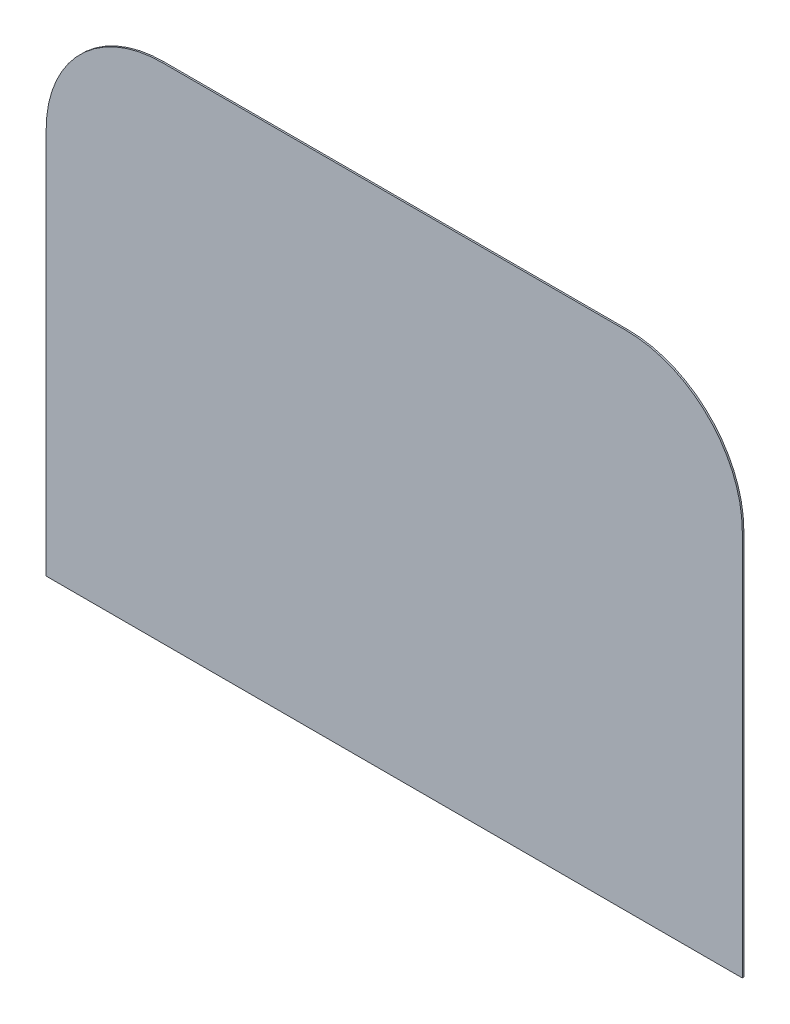
ISO-10303-21;
HEADER;
FILE_DESCRIPTION(('STEP AP214'),'2;1');
FILE_NAME('part.step','',(''),(''),'','','');
FILE_SCHEMA(('AUTOMOTIVE_DESIGN { 1 0 10303 214 1 1 1 1 }'));
ENDSEC;
DATA;
#1=APPLICATION_CONTEXT('core data for automotive mechanical design processes');
#2=APPLICATION_PROTOCOL_DEFINITION('international standard','automotive_design',2000,#1);
#3=PRODUCT_CONTEXT('',#1,'mechanical');
#4=PRODUCT('Part','Part','',(#3));
#5=PRODUCT_RELATED_PRODUCT_CATEGORY('part','',(#4));
#6=PRODUCT_DEFINITION_FORMATION('','',#4);
#7=PRODUCT_DEFINITION_CONTEXT('part definition',#1,'design');
#8=PRODUCT_DEFINITION('design','',#6,#7);
#9=PRODUCT_DEFINITION_SHAPE('','',#8);
#10=(LENGTH_UNIT() NAMED_UNIT(*) SI_UNIT(.MILLI.,.METRE.));
#11=(NAMED_UNIT(*) PLANE_ANGLE_UNIT() SI_UNIT($,.RADIAN.));
#12=(NAMED_UNIT(*) SI_UNIT($,.STERADIAN.) SOLID_ANGLE_UNIT());
#13=UNCERTAINTY_MEASURE_WITH_UNIT(LENGTH_MEASURE(1.E-05),#10,'distance_accuracy_value','');
#14=(GEOMETRIC_REPRESENTATION_CONTEXT(3) GLOBAL_UNCERTAINTY_ASSIGNED_CONTEXT((#13)) GLOBAL_UNIT_ASSIGNED_CONTEXT((#10,
#11,#12)) REPRESENTATION_CONTEXT('',''));
#15=CARTESIAN_POINT('',(0.,0.,0.));
#16=DIRECTION('',(0.,0.,1.));
#17=DIRECTION('',(1.,0.,0.));
#18=AXIS2_PLACEMENT_3D('',#15,#16,#17);
#19=CARTESIAN_POINT('',(297.350901998723,163.0081300813,1.));
#20=DIRECTION('',(-1.,0.,0.));
#21=DIRECTION('',(0.,0.,1.));
#22=AXIS2_PLACEMENT_3D('',#19,#20,#21);
#23=PLANE('',#22);
#24=DIRECTION('',(0.,1.,0.));
#25=VECTOR('',#24,1.);
#26=CARTESIAN_POINT('',(297.350901998723,163.0081300813,0.));
#27=LINE('',#26,#25);
#28=CARTESIAN_POINT('',(297.350901998723,-86.9918699186992,0.));
#29=VERTEX_POINT('',#28);
#30=CARTESIAN_POINT('',(297.350901998723,163.0081300813,0.));
#31=VERTEX_POINT('',#30);
#32=EDGE_CURVE('E121',#29,#31,#27,.T.);
#33=ORIENTED_EDGE('',*,*,#32,.T.);
#34=DIRECTION('',(0.,0.,-1.));
#35=VECTOR('',#34,1.);
#36=CARTESIAN_POINT('',(297.350901998723,163.0081300813,1.));
#37=LINE('',#36,#35);
#38=CARTESIAN_POINT('',(297.350901998723,163.0081300813,1.));
#39=VERTEX_POINT('',#38);
#40=EDGE_CURVE('E41',#39,#31,#37,.T.);
#41=ORIENTED_EDGE('',*,*,#40,.F.);
#42=DIRECTION('',(0.,1.,0.));
#43=VECTOR('',#42,1.);
#44=CARTESIAN_POINT('',(297.350901998723,163.0081300813,1.));
#45=LINE('',#44,#43);
#46=CARTESIAN_POINT('',(297.350901998723,-86.9918699186992,1.));
#47=VERTEX_POINT('',#46);
#48=EDGE_CURVE('E87',#47,#39,#45,.T.);
#49=ORIENTED_EDGE('',*,*,#48,.F.);
#50=DIRECTION('',(0.,0.,-1.));
#51=VECTOR('',#50,1.);
#52=CARTESIAN_POINT('',(297.350901998723,-86.9918699186992,1.));
#53=LINE('',#52,#51);
#54=EDGE_CURVE('E11',#47,#29,#53,.T.);
#55=ORIENTED_EDGE('',*,*,#54,.T.);
#56=EDGE_LOOP('',(#33,#41,#49,#55));
#57=FACE_BOUND('',#56,.T.);
#58=ADVANCED_FACE('F33',(#57),#23,.F.);
#59=CARTESIAN_POINT('',(222.350901998723,163.008130081301,1.));
#60=DIRECTION('',(0.,0.,-1.));
#61=DIRECTION('',(-1.,0.,0.));
#62=AXIS2_PLACEMENT_3D('',#59,#60,#61);
#63=CYLINDRICAL_SURFACE('',#62,75.);
#64=CARTESIAN_POINT('',(222.350901998723,163.008130081301,0.));
#65=DIRECTION('',(0.,0.,1.));
#66=DIRECTION('',(-1.,0.,0.));
#67=AXIS2_PLACEMENT_3D('',#64,#65,#66);
#68=CIRCLE('',#67,75.);
#69=CARTESIAN_POINT('',(222.350901998722,238.008130081301,0.));
#70=VERTEX_POINT('',#69);
#71=EDGE_CURVE('E123',#31,#70,#68,.T.);
#72=ORIENTED_EDGE('',*,*,#71,.T.);
#73=DIRECTION('',(0.,0.,-1.));
#74=VECTOR('',#73,1.);
#75=CARTESIAN_POINT('',(222.350901998722,238.008130081301,1.));
#76=LINE('',#75,#74);
#77=CARTESIAN_POINT('',(222.350901998722,238.008130081301,1.));
#78=VERTEX_POINT('',#77);
#79=EDGE_CURVE('E110',#78,#70,#76,.T.);
#80=ORIENTED_EDGE('',*,*,#79,.F.);
#81=CARTESIAN_POINT('',(222.350901998723,163.008130081301,1.));
#82=DIRECTION('',(0.,0.,1.));
#83=DIRECTION('',(-1.,0.,0.));
#84=AXIS2_PLACEMENT_3D('',#81,#82,#83);
#85=CIRCLE('',#84,75.);
#86=EDGE_CURVE('E101',#39,#78,#85,.T.);
#87=ORIENTED_EDGE('',*,*,#86,.F.);
#88=ORIENTED_EDGE('',*,*,#40,.T.);
#89=EDGE_LOOP('',(#72,#80,#87,#88));
#90=FACE_BOUND('',#89,.T.);
#91=ADVANCED_FACE('F135',(#90),#63,.T.);
#92=CARTESIAN_POINT('',(-77.6490980012769,238.008130081301,1.));
#93=DIRECTION('',(0.,-1.,0.));
#94=DIRECTION('',(0.,0.,-1.));
#95=AXIS2_PLACEMENT_3D('',#92,#93,#94);
#96=PLANE('',#95);
#97=DIRECTION('',(-1.,0.,0.));
#98=VECTOR('',#97,1.);
#99=CARTESIAN_POINT('',(-77.6490980012769,238.008130081301,0.));
#100=LINE('',#99,#98);
#101=CARTESIAN_POINT('',(-77.6490980012769,238.008130081301,0.));
#102=VERTEX_POINT('',#101);
#103=EDGE_CURVE('E109',#70,#102,#100,.T.);
#104=ORIENTED_EDGE('',*,*,#103,.T.);
#105=DIRECTION('',(0.,0.,-1.));
#106=VECTOR('',#105,1.);
#107=CARTESIAN_POINT('',(-77.6490980012769,238.008130081301,1.));
#108=LINE('',#107,#106);
#109=CARTESIAN_POINT('',(-77.6490980012769,238.008130081301,1.));
#110=VERTEX_POINT('',#109);
#111=EDGE_CURVE('E106',#110,#102,#108,.T.);
#112=ORIENTED_EDGE('',*,*,#111,.F.);
#113=DIRECTION('',(-1.,0.,0.));
#114=VECTOR('',#113,1.);
#115=CARTESIAN_POINT('',(-77.6490980012769,238.008130081301,1.));
#116=LINE('',#115,#114);
#117=EDGE_CURVE('E95',#78,#110,#116,.T.);
#118=ORIENTED_EDGE('',*,*,#117,.F.);
#119=ORIENTED_EDGE('',*,*,#79,.T.);
#120=EDGE_LOOP('',(#104,#112,#118,#119));
#121=FACE_BOUND('',#120,.T.);
#122=ADVANCED_FACE('F107',(#121),#96,.F.);
#123=CARTESIAN_POINT('',(-77.6490980012774,163.008130081301,1.));
#124=DIRECTION('',(0.,0.,-1.));
#125=DIRECTION('',(-1.,0.,0.));
#126=AXIS2_PLACEMENT_3D('',#123,#124,#125);
#127=CYLINDRICAL_SURFACE('',#126,75.);
#128=CARTESIAN_POINT('',(-77.6490980012774,163.008130081301,0.));
#129=DIRECTION('',(0.,0.,1.));
#130=DIRECTION('',(-1.,0.,0.));
#131=AXIS2_PLACEMENT_3D('',#128,#129,#130);
#132=CIRCLE('',#131,75.);
#133=CARTESIAN_POINT('',(-152.649098001277,163.0081300813,0.));
#134=VERTEX_POINT('',#133);
#135=EDGE_CURVE('E73',#102,#134,#132,.T.);
#136=ORIENTED_EDGE('',*,*,#135,.T.);
#137=DIRECTION('',(0.,0.,-1.));
#138=VECTOR('',#137,1.);
#139=CARTESIAN_POINT('',(-152.649098001277,163.0081300813,1.));
#140=LINE('',#139,#138);
#141=CARTESIAN_POINT('',(-152.649098001277,163.0081300813,1.));
#142=VERTEX_POINT('',#141);
#143=EDGE_CURVE('E111',#142,#134,#140,.T.);
#144=ORIENTED_EDGE('',*,*,#143,.F.);
#145=CARTESIAN_POINT('',(-77.6490980012774,163.008130081301,1.));
#146=DIRECTION('',(0.,0.,1.));
#147=DIRECTION('',(-1.,0.,0.));
#148=AXIS2_PLACEMENT_3D('',#145,#146,#147);
#149=CIRCLE('',#148,75.);
#150=EDGE_CURVE('E99',#110,#142,#149,.T.);
#151=ORIENTED_EDGE('',*,*,#150,.F.);
#152=ORIENTED_EDGE('',*,*,#111,.T.);
#153=EDGE_LOOP('',(#136,#144,#151,#152));
#154=FACE_BOUND('',#153,.T.);
#155=ADVANCED_FACE('F113',(#154),#127,.T.);
#156=CARTESIAN_POINT('',(-152.649098001277,-86.9918699186992,1.));
#157=DIRECTION('',(1.,0.,0.));
#158=DIRECTION('',(0.,0.,-1.));
#159=AXIS2_PLACEMENT_3D('',#156,#157,#158);
#160=PLANE('',#159);
#161=DIRECTION('',(0.,-1.,0.));
#162=VECTOR('',#161,1.);
#163=CARTESIAN_POINT('',(-152.649098001277,-86.9918699186992,0.));
#164=LINE('',#163,#162);
#165=CARTESIAN_POINT('',(-152.649098001277,-86.9918699186992,0.));
#166=VERTEX_POINT('',#165);
#167=EDGE_CURVE('E80',#134,#166,#164,.T.);
#168=ORIENTED_EDGE('',*,*,#167,.T.);
#169=DIRECTION('',(0.,0.,-1.));
#170=VECTOR('',#169,1.);
#171=CARTESIAN_POINT('',(-152.649098001277,-86.9918699186992,1.));
#172=LINE('',#171,#170);
#173=CARTESIAN_POINT('',(-152.649098001277,-86.9918699186992,1.));
#174=VERTEX_POINT('',#173);
#175=EDGE_CURVE('E117',#174,#166,#172,.T.);
#176=ORIENTED_EDGE('',*,*,#175,.F.);
#177=DIRECTION('',(0.,-1.,0.));
#178=VECTOR('',#177,1.);
#179=CARTESIAN_POINT('',(-152.649098001277,-86.9918699186992,1.));
#180=LINE('',#179,#178);
#181=EDGE_CURVE('E115',#142,#174,#180,.T.);
#182=ORIENTED_EDGE('',*,*,#181,.F.);
#183=ORIENTED_EDGE('',*,*,#143,.T.);
#184=EDGE_LOOP('',(#168,#176,#182,#183));
#185=FACE_BOUND('',#184,.T.);
#186=ADVANCED_FACE('F141',(#185),#160,.F.);
#187=CARTESIAN_POINT('',(-152.649098001277,-86.9918699186992,1.));
#188=DIRECTION('',(0.,1.,0.));
#189=DIRECTION('',(0.,0.,1.));
#190=AXIS2_PLACEMENT_3D('',#187,#188,#189);
#191=PLANE('',#190);
#192=DIRECTION('',(1.,0.,0.));
#193=VECTOR('',#192,1.);
#194=CARTESIAN_POINT('',(-152.649098001277,-86.9918699186992,0.));
#195=LINE('',#194,#193);
#196=EDGE_CURVE('E128',#166,#29,#195,.T.);
#197=ORIENTED_EDGE('',*,*,#196,.T.);
#198=ORIENTED_EDGE('',*,*,#54,.F.);
#199=DIRECTION('',(1.,0.,0.));
#200=VECTOR('',#199,1.);
#201=CARTESIAN_POINT('',(272.350901998723,-86.9918699186992,1.));
#202=LINE('',#201,#200);
#203=EDGE_CURVE('E49',#174,#47,#202,.T.);
#204=ORIENTED_EDGE('',*,*,#203,.F.);
#205=ORIENTED_EDGE('',*,*,#175,.T.);
#206=EDGE_LOOP('',(#197,#198,#204,#205));
#207=FACE_BOUND('',#206,.T.);
#208=ADVANCED_FACE('F140',(#207),#191,.F.);
#209=CARTESIAN_POINT('',(222.350901998723,163.008130081301,1.));
#210=DIRECTION('',(0.,0.,-1.));
#211=DIRECTION('',(-1.,0.,0.));
#212=AXIS2_PLACEMENT_3D('',#209,#210,#211);
#213=PLANE('',#212);
#214=ORIENTED_EDGE('',*,*,#203,.T.);
#215=ORIENTED_EDGE('',*,*,#48,.T.);
#216=ORIENTED_EDGE('',*,*,#86,.T.);
#217=ORIENTED_EDGE('',*,*,#117,.T.);
#218=ORIENTED_EDGE('',*,*,#150,.T.);
#219=ORIENTED_EDGE('',*,*,#181,.T.);
#220=EDGE_LOOP('',(#214,#215,#216,#217,#218,#219));
#221=FACE_BOUND('',#220,.T.);
#222=ADVANCED_FACE('F97',(#221),#213,.F.);
#223=CARTESIAN_POINT('',(222.350901998723,163.008130081301,0.));
#224=DIRECTION('',(0.,0.,-1.));
#225=DIRECTION('',(-1.,0.,0.));
#226=AXIS2_PLACEMENT_3D('',#223,#224,#225);
#227=PLANE('',#226);
#228=ORIENTED_EDGE('',*,*,#32,.F.);
#229=ORIENTED_EDGE('',*,*,#196,.F.);
#230=ORIENTED_EDGE('',*,*,#167,.F.);
#231=ORIENTED_EDGE('',*,*,#135,.F.);
#232=ORIENTED_EDGE('',*,*,#103,.F.);
#233=ORIENTED_EDGE('',*,*,#71,.F.);
#234=EDGE_LOOP('',(#228,#229,#230,#231,#232,#233));
#235=FACE_BOUND('',#234,.T.);
#236=ADVANCED_FACE('F138',(#235),#227,.T.);
#237=CLOSED_SHELL('',(#58,#91,#122,#155,#186,#208,#222,#236));
#238=MANIFOLD_SOLID_BREP('B2',#237);
#239=ADVANCED_BREP_SHAPE_REPRESENTATION('',(#18,#238),#14);
#240=SHAPE_DEFINITION_REPRESENTATION(#9,#239);
ENDSEC;
END-ISO-10303-21;
